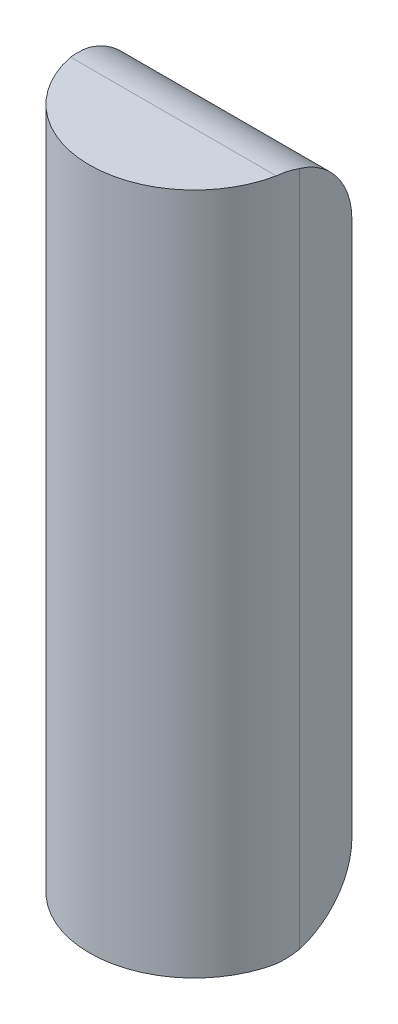
ISO-10303-21;
HEADER;
FILE_DESCRIPTION(('STEP AP214'),'2;1');
FILE_NAME('part.step','',(''),(''),'','','');
FILE_SCHEMA(('AUTOMOTIVE_DESIGN { 1 0 10303 214 1 1 1 1 }'));
ENDSEC;
DATA;
#1=APPLICATION_CONTEXT('core data for automotive mechanical design processes');
#2=APPLICATION_PROTOCOL_DEFINITION('international standard','automotive_design',2000,#1);
#3=PRODUCT_CONTEXT('',#1,'mechanical');
#4=PRODUCT('Part','Part','',(#3));
#5=PRODUCT_RELATED_PRODUCT_CATEGORY('part','',(#4));
#6=PRODUCT_DEFINITION_FORMATION('','',#4);
#7=PRODUCT_DEFINITION_CONTEXT('part definition',#1,'design');
#8=PRODUCT_DEFINITION('design','',#6,#7);
#9=PRODUCT_DEFINITION_SHAPE('','',#8);
#10=(LENGTH_UNIT() NAMED_UNIT(*) SI_UNIT(.MILLI.,.METRE.));
#11=(NAMED_UNIT(*) PLANE_ANGLE_UNIT() SI_UNIT($,.RADIAN.));
#12=(NAMED_UNIT(*) SI_UNIT($,.STERADIAN.) SOLID_ANGLE_UNIT());
#13=UNCERTAINTY_MEASURE_WITH_UNIT(LENGTH_MEASURE(1.E-05),#10,'distance_accuracy_value','');
#14=(GEOMETRIC_REPRESENTATION_CONTEXT(3) GLOBAL_UNCERTAINTY_ASSIGNED_CONTEXT((#13)) GLOBAL_UNIT_ASSIGNED_CONTEXT((#10,
#11,#12)) REPRESENTATION_CONTEXT('',''));
#15=CARTESIAN_POINT('',(0.,0.,0.));
#16=DIRECTION('',(0.,0.,1.));
#17=DIRECTION('',(1.,0.,0.));
#18=AXIS2_PLACEMENT_3D('',#15,#16,#17);
#19=CARTESIAN_POINT('',(0.6,0.,-0.35));
#20=DIRECTION('',(0.,1.,0.));
#21=DIRECTION('',(0.,0.,1.));
#22=AXIS2_PLACEMENT_3D('',#19,#20,#21);
#23=CYLINDRICAL_SURFACE('',#22,0.1);
#24=CARTESIAN_POINT('',(0.6,0.,-0.35));
#25=DIRECTION('',(0.,1.,0.));
#26=DIRECTION('',(0.,0.,1.));
#27=AXIS2_PLACEMENT_3D('',#24,#25,#26);
#28=CIRCLE('',#27,0.1);
#29=CARTESIAN_POINT('',(0.502020410288673,0.,-0.33));
#30=VERTEX_POINT('',#29);
#31=CARTESIAN_POINT('',(0.697979589711328,0.,-0.33));
#32=VERTEX_POINT('',#31);
#33=EDGE_CURVE('E11',#30,#32,#28,.T.);
#34=ORIENTED_EDGE('',*,*,#33,.T.);
#35=CARTESIAN_POINT('',(0.700000000000001,0.00291796067500541,-0.349999999999997));
#36=CARTESIAN_POINT('',(0.699915816237973,0.00267649394960225,-0.349190121189793));
#37=CARTESIAN_POINT('',(0.699831632475945,0.00244970743001088,-0.348375866058584));
#38=CARTESIAN_POINT('',(0.699663264951889,0.0020257616312339,-0.34673967912913));
#39=CARTESIAN_POINT('',(0.699579081189861,0.00182860235204829,-0.345917747330885));
#40=CARTESIAN_POINT('',(0.699410713665805,0.00146417786286507,-0.344267283042332));
#41=CARTESIAN_POINT('',(0.699326529903777,0.00129691265286744,-0.343438750552023));
#42=CARTESIAN_POINT('',(0.699158162379721,0.000992493455461797,-0.341776172212152));
#43=CARTESIAN_POINT('',(0.699073978617693,0.000855339468053776,-0.340942126362589));
#44=CARTESIAN_POINT('',(0.698905611093636,0.000611323369011889,-0.339269615138349));
#45=CARTESIAN_POINT('',(0.698821427331608,0.000504461257378023,-0.338431149763672));
#46=CARTESIAN_POINT('',(0.698653059807552,0.00032116831129557,-0.336750899341898));
#47=CARTESIAN_POINT('',(0.698568876045524,0.000244737476846983,-0.3359091142948));
#48=CARTESIAN_POINT('',(0.698400508521468,0.000122409650322953,-0.334223328579187));
#49=CARTESIAN_POINT('',(0.69831632475944,7.6512658247509E-05,-0.333379327910672));
#50=CARTESIAN_POINT('',(0.698147957235384,1.53042319068301E-05,-0.331690218311812));
#51=CARTESIAN_POINT('',(0.698063773473356,-7.20235840442677E-09,-0.330845109381467));
#52=CARTESIAN_POINT('',(0.697979589711328,0.,-0.33));
#53=B_SPLINE_CURVE_WITH_KNOTS('',3,(#35,#36,#37,#38,#39,#40,#41,#42,#43,#44,#45,#46,#47,#48,#49,
#50,#51,#52),.UNSPECIFIED.,.F.,.F.,(4,2,2,2,2,2,2,2,4),(0.,0.00254773712594259,
0.00509547425188521,0.00764321137782776,0.0101909485037704,0.012738685629713,0.0152864227556556,
0.0178341598815982,0.0203818970075408),.UNSPECIFIED.);
#54=CARTESIAN_POINT('',(0.700000000000001,0.00291796067500623,-0.35));
#55=VERTEX_POINT('',#54);
#56=EDGE_CURVE('E25',#55,#32,#53,.T.);
#57=ORIENTED_EDGE('',*,*,#56,.F.);
#58=DIRECTION('',(0.,1.,0.));
#59=VECTOR('',#58,1.);
#60=CARTESIAN_POINT('',(0.700000000000001,0.,-0.35));
#61=LINE('',#60,#59);
#62=CARTESIAN_POINT('',(0.700000000000001,0.647082039324994,-0.35));
#63=VERTEX_POINT('',#62);
#64=EDGE_CURVE('E73',#55,#63,#61,.T.);
#65=ORIENTED_EDGE('',*,*,#64,.T.);
#66=CARTESIAN_POINT('',(0.697979589711328,0.65,-0.33));
#67=CARTESIAN_POINT('',(0.698063773473356,0.650000007202358,-0.330845109381467));
#68=CARTESIAN_POINT('',(0.698147957235384,0.649984695768093,-0.331690218311812));
#69=CARTESIAN_POINT('',(0.69831632475944,0.649923487341753,-0.333379327910672));
#70=CARTESIAN_POINT('',(0.698400508521468,0.649877590349677,-0.334223328579187));
#71=CARTESIAN_POINT('',(0.698568876045524,0.649755262523153,-0.3359091142948));
#72=CARTESIAN_POINT('',(0.698653059807552,0.649678831688704,-0.336750899341897));
#73=CARTESIAN_POINT('',(0.698821427331608,0.649495538742622,-0.338431149763672));
#74=CARTESIAN_POINT('',(0.698905611093636,0.649388676630988,-0.339269615138349));
#75=CARTESIAN_POINT('',(0.699073978617693,0.649144660531946,-0.340942126362589));
#76=CARTESIAN_POINT('',(0.699158162379721,0.649007506544538,-0.341776172212152));
#77=CARTESIAN_POINT('',(0.699326529903777,0.648703087347133,-0.343438750552023));
#78=CARTESIAN_POINT('',(0.699410713665805,0.648535822137135,-0.344267283042332));
#79=CARTESIAN_POINT('',(0.699579081189861,0.648171397647952,-0.345917747330885));
#80=CARTESIAN_POINT('',(0.699663264951889,0.647974238368766,-0.34673967912913));
#81=CARTESIAN_POINT('',(0.699831632475945,0.647550292569989,-0.348375866058584));
#82=CARTESIAN_POINT('',(0.699915816237973,0.647323506050398,-0.349190121189793));
#83=CARTESIAN_POINT('',(0.700000000000001,0.647082039324995,-0.349999999999997));
#84=B_SPLINE_CURVE_WITH_KNOTS('',3,(#66,#67,#68,#69,#70,#71,#72,#73,#74,#75,#76,#77,#78,#79,#80,
#81,#82,#83),.UNSPECIFIED.,.F.,.F.,(4,2,2,2,2,2,2,2,4),(0.,0.00254773712594256,
0.00509547425188514,0.00764321137782775,0.0101909485037703,0.0127386856297129,
0.0152864227556554,0.0178341598815981,0.0203818970075407),.UNSPECIFIED.);
#85=CARTESIAN_POINT('',(0.697979589711328,0.65,-0.33));
#86=VERTEX_POINT('',#85);
#87=EDGE_CURVE('E198',#86,#63,#84,.T.);
#88=ORIENTED_EDGE('',*,*,#87,.F.);
#89=CARTESIAN_POINT('',(0.6,0.65,-0.35));
#90=DIRECTION('',(0.,1.,0.));
#91=DIRECTION('',(0.,0.,1.));
#92=AXIS2_PLACEMENT_3D('',#89,#90,#91);
#93=CIRCLE('',#92,0.1);
#94=CARTESIAN_POINT('',(0.502020410288673,0.65,-0.33));
#95=VERTEX_POINT('',#94);
#96=EDGE_CURVE('E208',#95,#86,#93,.T.);
#97=ORIENTED_EDGE('',*,*,#96,.F.);
#98=CARTESIAN_POINT('',(0.5,0.647082039324995,-0.349999999999997));
#99=CARTESIAN_POINT('',(0.500084183762028,0.647323506050398,-0.349190121189793));
#100=CARTESIAN_POINT('',(0.500168367524056,0.647550292569989,-0.348375866058584));
#101=CARTESIAN_POINT('',(0.500336735048112,0.647974238368766,-0.34673967912913));
#102=CARTESIAN_POINT('',(0.50042091881014,0.648171397647952,-0.345917747330885));
#103=CARTESIAN_POINT('',(0.500589286334196,0.648535822137135,-0.344267283042332));
#104=CARTESIAN_POINT('',(0.500673470096224,0.648703087347132,-0.343438750552023));
#105=CARTESIAN_POINT('',(0.50084183762028,0.649007506544538,-0.341776172212152));
#106=CARTESIAN_POINT('',(0.500926021382308,0.649144660531946,-0.340942126362589));
#107=CARTESIAN_POINT('',(0.501094388906365,0.649388676630988,-0.339269615138349));
#108=CARTESIAN_POINT('',(0.501178572668392,0.649495538742622,-0.338431149763672));
#109=CARTESIAN_POINT('',(0.501346940192449,0.649678831688704,-0.336750899341898));
#110=CARTESIAN_POINT('',(0.501431123954477,0.649755262523153,-0.3359091142948));
#111=CARTESIAN_POINT('',(0.501599491478533,0.649877590349677,-0.334223328579187));
#112=CARTESIAN_POINT('',(0.501683675240561,0.649923487341753,-0.333379327910672));
#113=CARTESIAN_POINT('',(0.501852042764617,0.649984695768093,-0.331690218311812));
#114=CARTESIAN_POINT('',(0.501936226526645,0.650000007202358,-0.330845109381467));
#115=CARTESIAN_POINT('',(0.502020410288673,0.65,-0.33));
#116=B_SPLINE_CURVE_WITH_KNOTS('',3,(#98,#99,#100,#101,#102,#103,#104,#105,#106,#107,#108,#109,
#110,#111,#112,#113,#114,#115),.UNSPECIFIED.,.F.,.F.,(4,2,2,2,2,2,2,2,4),(0.,0.0025477371259426,
0.0050954742518852,0.00764321137782769,0.0101909485037703,0.0127386856297129,0.0152864227556554,
0.0178341598815981,0.0203818970075407),.UNSPECIFIED.);
#117=CARTESIAN_POINT('',(0.5,0.647082039324994,-0.35));
#118=VERTEX_POINT('',#117);
#119=EDGE_CURVE('E210',#118,#95,#116,.T.);
#120=ORIENTED_EDGE('',*,*,#119,.F.);
#121=DIRECTION('',(0.,1.,0.));
#122=VECTOR('',#121,1.);
#123=CARTESIAN_POINT('',(0.5,0.,-0.35));
#124=LINE('',#123,#122);
#125=CARTESIAN_POINT('',(0.5,0.00291796067500537,-0.349999999999999));
#126=VERTEX_POINT('',#125);
#127=EDGE_CURVE('E214',#126,#118,#124,.T.);
#128=ORIENTED_EDGE('',*,*,#127,.F.);
#129=CARTESIAN_POINT('',(0.502020410288673,0.,-0.33));
#130=CARTESIAN_POINT('',(0.501936226526645,-7.20235840318018E-09,-0.330845109381467));
#131=CARTESIAN_POINT('',(0.501852042764617,1.53042319068318E-05,-0.331690218311812));
#132=CARTESIAN_POINT('',(0.501683675240561,7.65126582475072E-05,-0.333379327910672));
#133=CARTESIAN_POINT('',(0.501599491478533,0.000122409650322947,-0.334223328579187));
#134=CARTESIAN_POINT('',(0.501431123954477,0.000244737476846963,-0.335909114294799));
#135=CARTESIAN_POINT('',(0.501346940192449,0.00032116831129554,-0.336750899341897));
#136=CARTESIAN_POINT('',(0.501178572668392,0.000504461257377973,-0.338431149763672));
#137=CARTESIAN_POINT('',(0.501094388906365,0.000611323369011829,-0.339269615138349));
#138=CARTESIAN_POINT('',(0.500926021382308,0.000855339468053695,-0.340942126362589));
#139=CARTESIAN_POINT('',(0.50084183762028,0.000992493455461706,-0.341776172212152));
#140=CARTESIAN_POINT('',(0.500673470096224,0.00129691265286732,-0.343438750552023));
#141=CARTESIAN_POINT('',(0.500589286334196,0.00146417786286493,-0.344267283042331));
#142=CARTESIAN_POINT('',(0.50042091881014,0.00182860235204812,-0.345917747330884));
#143=CARTESIAN_POINT('',(0.500336735048112,0.0020257616312337,-0.346739679129129));
#144=CARTESIAN_POINT('',(0.500168367524056,0.00244970743001064,-0.348375866058583));
#145=CARTESIAN_POINT('',(0.500084183762028,0.002676493949602,-0.349190121189792));
#146=CARTESIAN_POINT('',(0.5,0.00291796067500513,-0.349999999999996));
#147=B_SPLINE_CURVE_WITH_KNOTS('',3,(#129,#130,#131,#132,#133,#134,#135,#136,#137,#138,#139,
#140,#141,#142,#143,#144,#145,#146),.UNSPECIFIED.,.F.,.F.,(4,2,2,2,2,2,2,2,4),(0.,
0.00254773712594245,0.00509547425188487,0.00764321137782737,0.0101909485037699,
0.0127386856297124,0.0152864227556549,0.0178341598815972,0.0203818970075397),.UNSPECIFIED.);
#148=EDGE_CURVE('E117',#30,#126,#147,.T.);
#149=ORIENTED_EDGE('',*,*,#148,.F.);
#150=EDGE_LOOP('',(#34,#57,#65,#88,#97,#120,#128,#149));
#151=FACE_BOUND('',#150,.T.);
#152=ADVANCED_FACE('F17',(#151),#23,.T.);
#153=CARTESIAN_POINT('',(0.5,0.,-0.4));
#154=DIRECTION('',(-1.,0.,0.));
#155=DIRECTION('',(0.,0.,1.));
#156=AXIS2_PLACEMENT_3D('',#153,#154,#155);
#157=PLANE('',#156);
#158=CARTESIAN_POINT('',(0.5,0.58,-0.33));
#159=DIRECTION('',(1.,0.,0.));
#160=DIRECTION('',(0.,0.,1.));
#161=AXIS2_PLACEMENT_3D('',#158,#159,#160);
#162=CIRCLE('',#161,0.07);
#163=CARTESIAN_POINT('',(0.5,0.58,-0.4));
#164=VERTEX_POINT('',#163);
#165=EDGE_CURVE('E112',#164,#118,#162,.T.);
#166=ORIENTED_EDGE('',*,*,#165,.F.);
#167=DIRECTION('',(0.,1.,0.));
#168=VECTOR('',#167,1.);
#169=CARTESIAN_POINT('',(0.5,0.,-0.4));
#170=LINE('',#169,#168);
#171=CARTESIAN_POINT('',(0.5,0.07,-0.4));
#172=VERTEX_POINT('',#171);
#173=EDGE_CURVE('E110',#172,#164,#170,.T.);
#174=ORIENTED_EDGE('',*,*,#173,.F.);
#175=CARTESIAN_POINT('',(0.5,0.07,-0.33));
#176=DIRECTION('',(1.,0.,0.));
#177=DIRECTION('',(0.,0.,1.));
#178=AXIS2_PLACEMENT_3D('',#175,#176,#177);
#179=CIRCLE('',#178,0.07);
#180=EDGE_CURVE('E90',#126,#172,#179,.T.);
#181=ORIENTED_EDGE('',*,*,#180,.F.);
#182=ORIENTED_EDGE('',*,*,#127,.T.);
#183=EDGE_LOOP('',(#166,#174,#181,#182));
#184=FACE_BOUND('',#183,.T.);
#185=ADVANCED_FACE('F165',(#184),#157,.T.);
#186=CARTESIAN_POINT('',(0.700000000000001,0.,-0.35));
#187=DIRECTION('',(1.,0.,0.));
#188=DIRECTION('',(0.,0.,-1.));
#189=AXIS2_PLACEMENT_3D('',#186,#187,#188);
#190=PLANE('',#189);
#191=CARTESIAN_POINT('',(0.700000000000001,0.58,-0.33));
#192=DIRECTION('',(-1.,0.,0.));
#193=DIRECTION('',(0.,0.,-1.));
#194=AXIS2_PLACEMENT_3D('',#191,#192,#193);
#195=CIRCLE('',#194,0.07);
#196=CARTESIAN_POINT('',(0.7,0.58,-0.4));
#197=VERTEX_POINT('',#196);
#198=EDGE_CURVE('E76',#63,#197,#195,.T.);
#199=ORIENTED_EDGE('',*,*,#198,.F.);
#200=ORIENTED_EDGE('',*,*,#64,.F.);
#201=CARTESIAN_POINT('',(0.700000000000001,0.07,-0.33));
#202=DIRECTION('',(-1.,0.,0.));
#203=DIRECTION('',(0.,0.,-1.));
#204=AXIS2_PLACEMENT_3D('',#201,#202,#203);
#205=CIRCLE('',#204,0.07);
#206=CARTESIAN_POINT('',(0.7,0.07,-0.4));
#207=VERTEX_POINT('',#206);
#208=EDGE_CURVE('E67',#207,#55,#205,.T.);
#209=ORIENTED_EDGE('',*,*,#208,.F.);
#210=DIRECTION('',(0.,1.,0.));
#211=VECTOR('',#210,1.);
#212=CARTESIAN_POINT('',(0.7,0.,-0.4));
#213=LINE('',#212,#211);
#214=EDGE_CURVE('E71',#207,#197,#213,.T.);
#215=ORIENTED_EDGE('',*,*,#214,.T.);
#216=EDGE_LOOP('',(#199,#200,#209,#215));
#217=FACE_BOUND('',#216,.T.);
#218=ADVANCED_FACE('F70',(#217),#190,.T.);
#219=CARTESIAN_POINT('',(0.,0.58,-0.33));
#220=DIRECTION('',(1.,0.,0.));
#221=DIRECTION('',(0.,0.,-1.));
#222=AXIS2_PLACEMENT_3D('',#219,#220,#221);
#223=CYLINDRICAL_SURFACE('',#222,0.07);
#224=DIRECTION('',(1.,0.,0.));
#225=VECTOR('',#224,1.);
#226=CARTESIAN_POINT('',(0.8,0.58,-0.4));
#227=LINE('',#226,#225);
#228=EDGE_CURVE('E84',#164,#197,#227,.T.);
#229=ORIENTED_EDGE('',*,*,#228,.F.);
#230=ORIENTED_EDGE('',*,*,#165,.T.);
#231=ORIENTED_EDGE('',*,*,#119,.T.);
#232=DIRECTION('',(-1.,0.,0.));
#233=VECTOR('',#232,1.);
#234=CARTESIAN_POINT('',(-0.8,0.65,-0.33));
#235=LINE('',#234,#233);
#236=EDGE_CURVE('E91',#86,#95,#235,.T.);
#237=ORIENTED_EDGE('',*,*,#236,.F.);
#238=ORIENTED_EDGE('',*,*,#87,.T.);
#239=ORIENTED_EDGE('',*,*,#198,.T.);
#240=EDGE_LOOP('',(#229,#230,#231,#237,#238,#239));
#241=FACE_BOUND('',#240,.T.);
#242=ADVANCED_FACE('F173',(#241),#223,.T.);
#243=CARTESIAN_POINT('',(0.,0.65,0.));
#244=DIRECTION('',(0.,1.,0.));
#245=DIRECTION('',(0.,0.,1.));
#246=AXIS2_PLACEMENT_3D('',#243,#244,#245);
#247=PLANE('',#246);
#248=ORIENTED_EDGE('',*,*,#236,.T.);
#249=ORIENTED_EDGE('',*,*,#96,.T.);
#250=EDGE_LOOP('',(#248,#249));
#251=FACE_BOUND('',#250,.T.);
#252=ADVANCED_FACE('F143',(#251),#247,.T.);
#253=CARTESIAN_POINT('',(0.8,0.07,-0.33));
#254=DIRECTION('',(-1.,0.,0.));
#255=DIRECTION('',(0.,0.,1.));
#256=AXIS2_PLACEMENT_3D('',#253,#254,#255);
#257=CYLINDRICAL_SURFACE('',#256,0.07);
#258=ORIENTED_EDGE('',*,*,#148,.T.);
#259=ORIENTED_EDGE('',*,*,#180,.T.);
#260=DIRECTION('',(-1.,0.,0.));
#261=VECTOR('',#260,1.);
#262=CARTESIAN_POINT('',(0.8,0.07,-0.4));
#263=LINE('',#262,#261);
#264=EDGE_CURVE('E82',#207,#172,#263,.T.);
#265=ORIENTED_EDGE('',*,*,#264,.F.);
#266=ORIENTED_EDGE('',*,*,#208,.T.);
#267=ORIENTED_EDGE('',*,*,#56,.T.);
#268=DIRECTION('',(1.,0.,0.));
#269=VECTOR('',#268,1.);
#270=CARTESIAN_POINT('',(0.,0.,-0.33));
#271=LINE('',#270,#269);
#272=EDGE_CURVE('E92',#30,#32,#271,.T.);
#273=ORIENTED_EDGE('',*,*,#272,.F.);
#274=EDGE_LOOP('',(#258,#259,#265,#266,#267,#273));
#275=FACE_BOUND('',#274,.T.);
#276=ADVANCED_FACE('F88',(#275),#257,.T.);
#277=CARTESIAN_POINT('',(0.,0.,0.));
#278=DIRECTION('',(0.,1.,0.));
#279=DIRECTION('',(0.,0.,1.));
#280=AXIS2_PLACEMENT_3D('',#277,#278,#279);
#281=PLANE('',#280);
#282=ORIENTED_EDGE('',*,*,#33,.F.);
#283=ORIENTED_EDGE('',*,*,#272,.T.);
#284=EDGE_LOOP('',(#282,#283));
#285=FACE_BOUND('',#284,.T.);
#286=ADVANCED_FACE('F142',(#285),#281,.F.);
#287=CARTESIAN_POINT('',(0.8,0.65,-0.4));
#288=DIRECTION('',(0.,0.,1.));
#289=DIRECTION('',(1.,0.,0.));
#290=AXIS2_PLACEMENT_3D('',#287,#288,#289);
#291=PLANE('',#290);
#292=ORIENTED_EDGE('',*,*,#214,.F.);
#293=ORIENTED_EDGE('',*,*,#264,.T.);
#294=ORIENTED_EDGE('',*,*,#173,.T.);
#295=ORIENTED_EDGE('',*,*,#228,.T.);
#296=EDGE_LOOP('',(#292,#293,#294,#295));
#297=FACE_BOUND('',#296,.T.);
#298=ADVANCED_FACE('F80',(#297),#291,.F.);
#299=CLOSED_SHELL('',(#152,#185,#218,#242,#252,#276,#286,#298));
#300=MANIFOLD_SOLID_BREP('B1',#299);
#301=ADVANCED_BREP_SHAPE_REPRESENTATION('',(#18,#300),#14);
#302=SHAPE_DEFINITION_REPRESENTATION(#9,#301);
ENDSEC;
END-ISO-10303-21;
